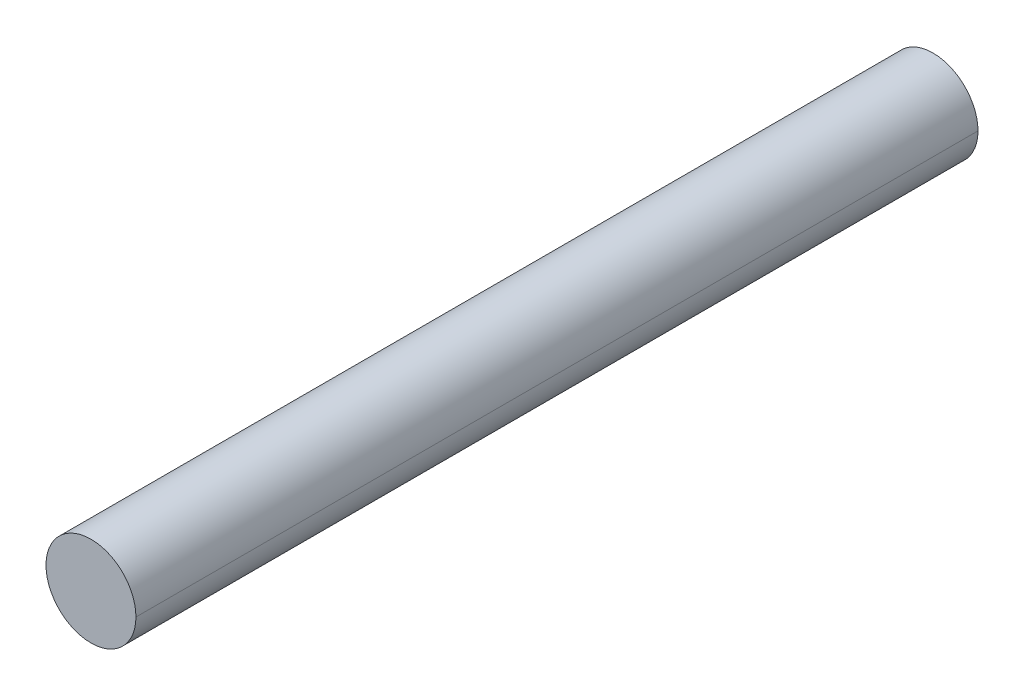
ISO-10303-21;
HEADER;
FILE_DESCRIPTION(('STEP AP214'),'2;1');
FILE_NAME('part.step','',(''),(''),'','','');
FILE_SCHEMA(('AUTOMOTIVE_DESIGN { 1 0 10303 214 1 1 1 1 }'));
ENDSEC;
DATA;
#1=APPLICATION_CONTEXT('core data for automotive mechanical design processes');
#2=APPLICATION_PROTOCOL_DEFINITION('international standard','automotive_design',2000,#1);
#3=PRODUCT_CONTEXT('',#1,'mechanical');
#4=PRODUCT('Part','Part','',(#3));
#5=PRODUCT_RELATED_PRODUCT_CATEGORY('part','',(#4));
#6=PRODUCT_DEFINITION_FORMATION('','',#4);
#7=PRODUCT_DEFINITION_CONTEXT('part definition',#1,'design');
#8=PRODUCT_DEFINITION('design','',#6,#7);
#9=PRODUCT_DEFINITION_SHAPE('','',#8);
#10=(LENGTH_UNIT() NAMED_UNIT(*) SI_UNIT(.MILLI.,.METRE.));
#11=(NAMED_UNIT(*) PLANE_ANGLE_UNIT() SI_UNIT($,.RADIAN.));
#12=(NAMED_UNIT(*) SI_UNIT($,.STERADIAN.) SOLID_ANGLE_UNIT());
#13=UNCERTAINTY_MEASURE_WITH_UNIT(LENGTH_MEASURE(1.E-05),#10,'distance_accuracy_value','');
#14=(GEOMETRIC_REPRESENTATION_CONTEXT(3) GLOBAL_UNCERTAINTY_ASSIGNED_CONTEXT((#13)) GLOBAL_UNIT_ASSIGNED_CONTEXT((#10,
#11,#12)) REPRESENTATION_CONTEXT('',''));
#15=CARTESIAN_POINT('',(0.,0.,0.));
#16=DIRECTION('',(0.,0.,1.));
#17=DIRECTION('',(1.,0.,0.));
#18=AXIS2_PLACEMENT_3D('',#15,#16,#17);
#19=CARTESIAN_POINT('',(0.,0.,-25.));
#20=DIRECTION('',(0.,0.,-1.));
#21=DIRECTION('',(0.,1.,0.));
#22=AXIS2_PLACEMENT_3D('',#19,#20,#21);
#23=CYLINDRICAL_SURFACE('',#22,1.335);
#24=CARTESIAN_POINT('',(0.,0.,-25.));
#25=DIRECTION('',(0.,0.,1.));
#26=DIRECTION('',(1.,0.,0.));
#27=AXIS2_PLACEMENT_3D('',#24,#25,#26);
#28=CIRCLE('',#27,1.335);
#29=CARTESIAN_POINT('',(-1.335,0.,-25.));
#30=VERTEX_POINT('',#29);
#31=CARTESIAN_POINT('',(1.335,0.,-25.));
#32=VERTEX_POINT('',#31);
#33=EDGE_CURVE('E11',#30,#32,#28,.T.);
#34=ORIENTED_EDGE('',*,*,#33,.T.);
#35=DIRECTION('',(0.,0.,-1.));
#36=VECTOR('',#35,1.);
#37=CARTESIAN_POINT('',(1.335,0.,0.));
#38=LINE('',#37,#36);
#39=CARTESIAN_POINT('',(1.335,0.,0.));
#40=VERTEX_POINT('',#39);
#41=EDGE_CURVE('E25',#40,#32,#38,.T.);
#42=ORIENTED_EDGE('',*,*,#41,.F.);
#43=CARTESIAN_POINT('',(0.,0.,0.));
#44=DIRECTION('',(0.,0.,1.));
#45=DIRECTION('',(1.,0.,0.));
#46=AXIS2_PLACEMENT_3D('',#43,#44,#45);
#47=CIRCLE('',#46,1.335);
#48=CARTESIAN_POINT('',(-1.335,0.,0.));
#49=VERTEX_POINT('',#48);
#50=EDGE_CURVE('E42',#49,#40,#47,.T.);
#51=ORIENTED_EDGE('',*,*,#50,.F.);
#52=DIRECTION('',(0.,0.,-1.));
#53=VECTOR('',#52,1.);
#54=CARTESIAN_POINT('',(-1.335,0.,0.));
#55=LINE('',#54,#53);
#56=EDGE_CURVE('E39',#49,#30,#55,.T.);
#57=ORIENTED_EDGE('',*,*,#56,.T.);
#58=EDGE_LOOP('',(#34,#42,#51,#57));
#59=FACE_BOUND('',#58,.T.);
#60=ADVANCED_FACE('F17',(#59),#23,.T.);
#61=CARTESIAN_POINT('',(0.,0.,-25.));
#62=DIRECTION('',(0.,0.,-1.));
#63=DIRECTION('',(0.,-1.,0.));
#64=AXIS2_PLACEMENT_3D('',#61,#62,#63);
#65=CYLINDRICAL_SURFACE('',#64,1.335);
#66=CARTESIAN_POINT('',(0.,0.,0.));
#67=DIRECTION('',(0.,0.,1.));
#68=DIRECTION('',(1.,0.,0.));
#69=AXIS2_PLACEMENT_3D('',#66,#67,#68);
#70=CIRCLE('',#69,1.335);
#71=EDGE_CURVE('E45',#40,#49,#70,.T.);
#72=ORIENTED_EDGE('',*,*,#71,.F.);
#73=ORIENTED_EDGE('',*,*,#41,.T.);
#74=CARTESIAN_POINT('',(0.,0.,-25.));
#75=DIRECTION('',(0.,0.,1.));
#76=DIRECTION('',(1.,0.,0.));
#77=AXIS2_PLACEMENT_3D('',#74,#75,#76);
#78=CIRCLE('',#77,1.335);
#79=EDGE_CURVE('E48',#32,#30,#78,.T.);
#80=ORIENTED_EDGE('',*,*,#79,.T.);
#81=ORIENTED_EDGE('',*,*,#56,.F.);
#82=EDGE_LOOP('',(#72,#73,#80,#81));
#83=FACE_BOUND('',#82,.T.);
#84=ADVANCED_FACE('F49',(#83),#65,.T.);
#85=CARTESIAN_POINT('',(0.,0.,-25.));
#86=DIRECTION('',(0.,0.,1.));
#87=DIRECTION('',(1.,0.,0.));
#88=AXIS2_PLACEMENT_3D('',#85,#86,#87);
#89=PLANE('',#88);
#90=ORIENTED_EDGE('',*,*,#79,.F.);
#91=ORIENTED_EDGE('',*,*,#33,.F.);
#92=EDGE_LOOP('',(#90,#91));
#93=FACE_BOUND('',#92,.T.);
#94=ADVANCED_FACE('F52',(#93),#89,.F.);
#95=CARTESIAN_POINT('',(0.,0.,0.));
#96=DIRECTION('',(0.,0.,1.));
#97=DIRECTION('',(1.,0.,0.));
#98=AXIS2_PLACEMENT_3D('',#95,#96,#97);
#99=PLANE('',#98);
#100=ORIENTED_EDGE('',*,*,#71,.T.);
#101=ORIENTED_EDGE('',*,*,#50,.T.);
#102=EDGE_LOOP('',(#100,#101));
#103=FACE_BOUND('',#102,.T.);
#104=ADVANCED_FACE('F54',(#103),#99,.T.);
#105=CLOSED_SHELL('',(#60,#84,#94,#104));
#106=MANIFOLD_SOLID_BREP('B1',#105);
#107=ADVANCED_BREP_SHAPE_REPRESENTATION('',(#18,#106),#14);
#108=SHAPE_DEFINITION_REPRESENTATION(#9,#107);
ENDSEC;
END-ISO-10303-21;
